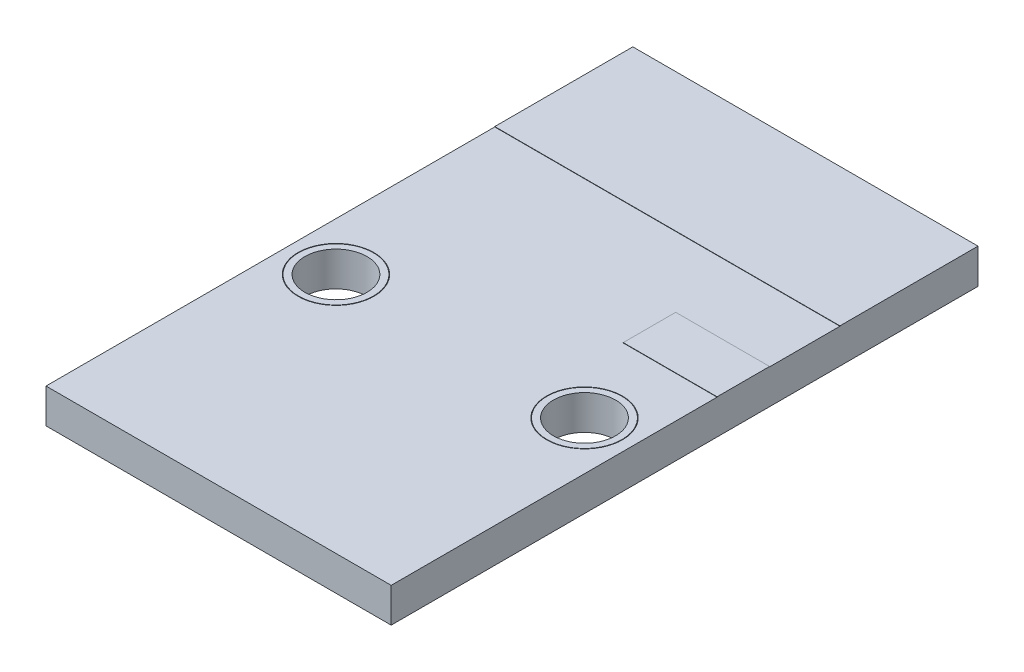
ISO-10303-21;
HEADER;
FILE_DESCRIPTION(('STEP AP214'),'2;1');
FILE_NAME('part.step','',(''),(''),'','','');
FILE_SCHEMA(('AUTOMOTIVE_DESIGN { 1 0 10303 214 1 1 1 1 }'));
ENDSEC;
DATA;
#1=APPLICATION_CONTEXT('core data for automotive mechanical design processes');
#2=APPLICATION_PROTOCOL_DEFINITION('international standard','automotive_design',2000,#1);
#3=PRODUCT_CONTEXT('',#1,'mechanical');
#4=PRODUCT('Part','Part','',(#3));
#5=PRODUCT_RELATED_PRODUCT_CATEGORY('part','',(#4));
#6=PRODUCT_DEFINITION_FORMATION('','',#4);
#7=PRODUCT_DEFINITION_CONTEXT('part definition',#1,'design');
#8=PRODUCT_DEFINITION('design','',#6,#7);
#9=PRODUCT_DEFINITION_SHAPE('','',#8);
#10=(LENGTH_UNIT() NAMED_UNIT(*) SI_UNIT(.MILLI.,.METRE.));
#11=(NAMED_UNIT(*) PLANE_ANGLE_UNIT() SI_UNIT($,.RADIAN.));
#12=(NAMED_UNIT(*) SI_UNIT($,.STERADIAN.) SOLID_ANGLE_UNIT());
#13=UNCERTAINTY_MEASURE_WITH_UNIT(LENGTH_MEASURE(1.E-05),#10,'distance_accuracy_value','');
#14=(GEOMETRIC_REPRESENTATION_CONTEXT(3) GLOBAL_UNCERTAINTY_ASSIGNED_CONTEXT((#13)) GLOBAL_UNIT_ASSIGNED_CONTEXT((#10,
#11,#12)) REPRESENTATION_CONTEXT('',''));
#15=CARTESIAN_POINT('',(0.,0.,0.));
#16=DIRECTION('',(0.,0.,1.));
#17=DIRECTION('',(1.,0.,0.));
#18=AXIS2_PLACEMENT_3D('',#15,#16,#17);
#19=CARTESIAN_POINT('',(1.4,0.,10.));
#20=DIRECTION('',(0.,1.,0.));
#21=DIRECTION('',(0.,0.,1.));
#22=AXIS2_PLACEMENT_3D('',#19,#20,#21);
#23=CYLINDRICAL_SURFACE('',#22,1.0854263270172);
#24=CARTESIAN_POINT('',(1.4,0.,10.));
#25=DIRECTION('',(0.,1.,0.));
#26=DIRECTION('',(0.,0.,1.));
#27=AXIS2_PLACEMENT_3D('',#24,#25,#26);
#28=CIRCLE('',#27,1.0854263270172);
#29=CARTESIAN_POINT('',(1.4,0.,11.0854263270172));
#30=VERTEX_POINT('',#29);
#31=EDGE_CURVE('E11',#30,#30,#28,.T.);
#32=ORIENTED_EDGE('',*,*,#31,.T.);
#33=EDGE_LOOP('',(#32));
#34=FACE_BOUND('',#33,.T.);
#35=CARTESIAN_POINT('',(1.4,1.,10.));
#36=DIRECTION('',(0.,1.,0.));
#37=DIRECTION('',(0.,0.,1.));
#38=AXIS2_PLACEMENT_3D('',#35,#36,#37);
#39=CIRCLE('',#38,1.0854263270172);
#40=CARTESIAN_POINT('',(1.4,1.,11.0854263270172));
#41=VERTEX_POINT('',#40);
#42=EDGE_CURVE('E48',#41,#41,#39,.T.);
#43=ORIENTED_EDGE('',*,*,#42,.F.);
#44=EDGE_LOOP('',(#43));
#45=FACE_BOUND('',#44,.T.);
#46=ADVANCED_FACE('F45',(#34,#45),#23,.T.);
#47=CARTESIAN_POINT('',(1.4,0.,10.));
#48=DIRECTION('',(0.,1.,0.));
#49=DIRECTION('',(0.,0.,1.));
#50=AXIS2_PLACEMENT_3D('',#47,#48,#49);
#51=PLANE('',#50);
#52=CARTESIAN_POINT('',(1.4,0.,10.));
#53=DIRECTION('',(0.,1.,0.));
#54=DIRECTION('',(0.,0.,1.));
#55=AXIS2_PLACEMENT_3D('',#52,#53,#54);
#56=CIRCLE('',#55,0.9);
#57=CARTESIAN_POINT('',(1.4,0.,10.9));
#58=VERTEX_POINT('',#57);
#59=EDGE_CURVE('E55',#58,#58,#56,.T.);
#60=ORIENTED_EDGE('',*,*,#59,.T.);
#61=EDGE_LOOP('',(#60));
#62=FACE_BOUND('',#61,.T.);
#63=ORIENTED_EDGE('',*,*,#31,.F.);
#64=EDGE_LOOP('',(#63));
#65=FACE_BOUND('',#64,.T.);
#66=ADVANCED_FACE('F63',(#62,#65),#51,.F.);
#67=CARTESIAN_POINT('',(1.4,1.,10.));
#68=DIRECTION('',(0.,1.,0.));
#69=DIRECTION('',(0.,0.,1.));
#70=AXIS2_PLACEMENT_3D('',#67,#68,#69);
#71=PLANE('',#70);
#72=CARTESIAN_POINT('',(1.4,1.,10.));
#73=DIRECTION('',(0.,1.,0.));
#74=DIRECTION('',(0.,0.,1.));
#75=AXIS2_PLACEMENT_3D('',#72,#73,#74);
#76=CIRCLE('',#75,0.9);
#77=CARTESIAN_POINT('',(1.4,1.,10.9));
#78=VERTEX_POINT('',#77);
#79=EDGE_CURVE('E57',#78,#78,#76,.T.);
#80=ORIENTED_EDGE('',*,*,#79,.F.);
#81=EDGE_LOOP('',(#80));
#82=FACE_BOUND('',#81,.T.);
#83=ORIENTED_EDGE('',*,*,#42,.T.);
#84=EDGE_LOOP('',(#83));
#85=FACE_BOUND('',#84,.T.);
#86=ADVANCED_FACE('F69',(#82,#85),#71,.T.);
#87=CARTESIAN_POINT('',(1.4,0.,10.));
#88=DIRECTION('',(0.,1.,0.));
#89=DIRECTION('',(0.,0.,1.));
#90=AXIS2_PLACEMENT_3D('',#87,#88,#89);
#91=CYLINDRICAL_SURFACE('',#90,0.9);
#92=ORIENTED_EDGE('',*,*,#59,.F.);
#93=EDGE_LOOP('',(#92));
#94=FACE_BOUND('',#93,.T.);
#95=ORIENTED_EDGE('',*,*,#79,.T.);
#96=EDGE_LOOP('',(#95));
#97=FACE_BOUND('',#96,.T.);
#98=ADVANCED_FACE('F66',(#94,#97),#91,.F.);
#99=CLOSED_SHELL('',(#46,#66,#86,#98));
#100=MANIFOLD_SOLID_BREP('B2',#99);
#101=CARTESIAN_POINT('',(8.6,0.,10.));
#102=DIRECTION('',(0.,1.,0.));
#103=DIRECTION('',(0.,0.,1.));
#104=AXIS2_PLACEMENT_3D('',#101,#102,#103);
#105=CYLINDRICAL_SURFACE('',#104,1.08573606300248);
#106=CARTESIAN_POINT('',(8.6,0.,10.));
#107=DIRECTION('',(0.,1.,0.));
#108=DIRECTION('',(0.,0.,1.));
#109=AXIS2_PLACEMENT_3D('',#106,#107,#108);
#110=CIRCLE('',#109,1.08573606300248);
#111=CARTESIAN_POINT('',(8.6,0.,11.0857360630025));
#112=VERTEX_POINT('',#111);
#113=EDGE_CURVE('E44',#112,#112,#110,.T.);
#114=ORIENTED_EDGE('',*,*,#113,.T.);
#115=EDGE_LOOP('',(#114));
#116=FACE_BOUND('',#115,.T.);
#117=CARTESIAN_POINT('',(8.6,1.,10.));
#118=DIRECTION('',(0.,1.,0.));
#119=DIRECTION('',(0.,0.,1.));
#120=AXIS2_PLACEMENT_3D('',#117,#118,#119);
#121=CIRCLE('',#120,1.08573606300248);
#122=CARTESIAN_POINT('',(8.6,1.,11.0857360630025));
#123=VERTEX_POINT('',#122);
#124=EDGE_CURVE('E118',#123,#123,#121,.T.);
#125=ORIENTED_EDGE('',*,*,#124,.F.);
#126=EDGE_LOOP('',(#125));
#127=FACE_BOUND('',#126,.T.);
#128=ADVANCED_FACE('F115',(#116,#127),#105,.T.);
#129=CARTESIAN_POINT('',(8.6,0.,10.));
#130=DIRECTION('',(0.,1.,0.));
#131=DIRECTION('',(0.,0.,1.));
#132=AXIS2_PLACEMENT_3D('',#129,#130,#131);
#133=PLANE('',#132);
#134=CARTESIAN_POINT('',(8.6,0.,10.));
#135=DIRECTION('',(0.,1.,0.));
#136=DIRECTION('',(0.,0.,1.));
#137=AXIS2_PLACEMENT_3D('',#134,#135,#136);
#138=CIRCLE('',#137,0.900000000000002);
#139=CARTESIAN_POINT('',(8.6,0.,10.9));
#140=VERTEX_POINT('',#139);
#141=EDGE_CURVE('E125',#140,#140,#138,.T.);
#142=ORIENTED_EDGE('',*,*,#141,.T.);
#143=EDGE_LOOP('',(#142));
#144=FACE_BOUND('',#143,.T.);
#145=ORIENTED_EDGE('',*,*,#113,.F.);
#146=EDGE_LOOP('',(#145));
#147=FACE_BOUND('',#146,.T.);
#148=ADVANCED_FACE('F133',(#144,#147),#133,.F.);
#149=CARTESIAN_POINT('',(8.6,1.,10.));
#150=DIRECTION('',(0.,1.,0.));
#151=DIRECTION('',(0.,0.,1.));
#152=AXIS2_PLACEMENT_3D('',#149,#150,#151);
#153=PLANE('',#152);
#154=CARTESIAN_POINT('',(8.6,1.,10.));
#155=DIRECTION('',(0.,1.,0.));
#156=DIRECTION('',(0.,0.,1.));
#157=AXIS2_PLACEMENT_3D('',#154,#155,#156);
#158=CIRCLE('',#157,0.900000000000002);
#159=CARTESIAN_POINT('',(8.6,1.,10.9));
#160=VERTEX_POINT('',#159);
#161=EDGE_CURVE('E127',#160,#160,#158,.T.);
#162=ORIENTED_EDGE('',*,*,#161,.F.);
#163=EDGE_LOOP('',(#162));
#164=FACE_BOUND('',#163,.T.);
#165=ORIENTED_EDGE('',*,*,#124,.T.);
#166=EDGE_LOOP('',(#165));
#167=FACE_BOUND('',#166,.T.);
#168=ADVANCED_FACE('F139',(#164,#167),#153,.T.);
#169=CARTESIAN_POINT('',(8.6,0.,10.));
#170=DIRECTION('',(0.,1.,0.));
#171=DIRECTION('',(0.,0.,1.));
#172=AXIS2_PLACEMENT_3D('',#169,#170,#171);
#173=CYLINDRICAL_SURFACE('',#172,0.900000000000002);
#174=ORIENTED_EDGE('',*,*,#141,.F.);
#175=EDGE_LOOP('',(#174));
#176=FACE_BOUND('',#175,.T.);
#177=ORIENTED_EDGE('',*,*,#161,.T.);
#178=EDGE_LOOP('',(#177));
#179=FACE_BOUND('',#178,.T.);
#180=ADVANCED_FACE('F136',(#176,#179),#173,.F.);
#181=CLOSED_SHELL('',(#128,#148,#168,#180));
#182=MANIFOLD_SOLID_BREP('B6',#181);
#183=CARTESIAN_POINT('',(0.,1.,0.));
#184=DIRECTION('',(0.,1.,0.));
#185=DIRECTION('',(0.,0.,1.));
#186=AXIS2_PLACEMENT_3D('',#183,#184,#185);
#187=PLANE('',#186);
#188=CARTESIAN_POINT('',(1.4,1.,10.));
#189=DIRECTION('',(0.,1.,0.));
#190=DIRECTION('',(0.,0.,1.));
#191=AXIS2_PLACEMENT_3D('',#188,#189,#190);
#192=CIRCLE('',#191,1.1);
#193=CARTESIAN_POINT('',(1.4,1.,11.1));
#194=VERTEX_POINT('',#193);
#195=EDGE_CURVE('E303',#194,#194,#192,.T.);
#196=ORIENTED_EDGE('',*,*,#195,.F.);
#197=EDGE_LOOP('',(#196));
#198=FACE_BOUND('',#197,.T.);
#199=CARTESIAN_POINT('',(8.6,1.,10.));
#200=DIRECTION('',(0.,1.,0.));
#201=DIRECTION('',(0.,0.,1.));
#202=AXIS2_PLACEMENT_3D('',#199,#200,#201);
#203=CIRCLE('',#202,1.1);
#204=CARTESIAN_POINT('',(8.6,1.,11.1));
#205=VERTEX_POINT('',#204);
#206=EDGE_CURVE('E298',#205,#205,#203,.T.);
#207=ORIENTED_EDGE('',*,*,#206,.F.);
#208=EDGE_LOOP('',(#207));
#209=FACE_BOUND('',#208,.T.);
#210=DIRECTION('',(0.,0.,1.));
#211=VECTOR('',#210,1.);
#212=CARTESIAN_POINT('',(7.28121156624932,1.,6.03870807749108));
#213=LINE('',#212,#211);
#214=CARTESIAN_POINT('',(7.28121156624932,1.,6.03870807749108));
#215=VERTEX_POINT('',#214);
#216=CARTESIAN_POINT('',(7.28121156624932,1.,7.55868921206423));
#217=VERTEX_POINT('',#216);
#218=EDGE_CURVE('E388',#215,#217,#213,.T.);
#219=ORIENTED_EDGE('',*,*,#218,.F.);
#220=DIRECTION('',(-1.,0.,0.));
#221=VECTOR('',#220,1.);
#222=CARTESIAN_POINT('',(10.,1.,6.03870807749108));
#223=LINE('',#222,#221);
#224=CARTESIAN_POINT('',(10.,1.,6.03870807749108));
#225=VERTEX_POINT('',#224);
#226=EDGE_CURVE('E390',#225,#215,#223,.T.);
#227=ORIENTED_EDGE('',*,*,#226,.F.);
#228=DIRECTION('',(0.,0.,-1.));
#229=VECTOR('',#228,1.);
#230=CARTESIAN_POINT('',(10.,1.,0.));
#231=LINE('',#230,#229);
#232=CARTESIAN_POINT('',(10.,1.,4.));
#233=VERTEX_POINT('',#232);
#234=EDGE_CURVE('E277',#225,#233,#231,.T.);
#235=ORIENTED_EDGE('',*,*,#234,.T.);
#236=DIRECTION('',(1.,0.,0.));
#237=VECTOR('',#236,1.);
#238=CARTESIAN_POINT('',(10.,1.,4.));
#239=LINE('',#238,#237);
#240=CARTESIAN_POINT('',(0.,1.,4.));
#241=VERTEX_POINT('',#240);
#242=EDGE_CURVE('E199',#241,#233,#239,.T.);
#243=ORIENTED_EDGE('',*,*,#242,.F.);
#244=DIRECTION('',(0.,0.,1.));
#245=VECTOR('',#244,1.);
#246=CARTESIAN_POINT('',(0.,1.,0.));
#247=LINE('',#246,#245);
#248=CARTESIAN_POINT('',(0.,1.,17.));
#249=VERTEX_POINT('',#248);
#250=EDGE_CURVE('E311',#241,#249,#247,.T.);
#251=ORIENTED_EDGE('',*,*,#250,.T.);
#252=DIRECTION('',(1.,0.,0.));
#253=VECTOR('',#252,1.);
#254=CARTESIAN_POINT('',(0.,1.,17.));
#255=LINE('',#254,#253);
#256=CARTESIAN_POINT('',(10.,1.,17.));
#257=VERTEX_POINT('',#256);
#258=EDGE_CURVE('E313',#249,#257,#255,.T.);
#259=ORIENTED_EDGE('',*,*,#258,.T.);
#260=CARTESIAN_POINT('',(10.,1.,7.55868921206423));
#261=VERTEX_POINT('',#260);
#262=EDGE_CURVE('E316',#257,#261,#231,.T.);
#263=ORIENTED_EDGE('',*,*,#262,.T.);
#264=DIRECTION('',(1.,0.,0.));
#265=VECTOR('',#264,1.);
#266=CARTESIAN_POINT('',(10.,1.,7.55868921206423));
#267=LINE('',#266,#265);
#268=EDGE_CURVE('E272',#217,#261,#267,.T.);
#269=ORIENTED_EDGE('',*,*,#268,.F.);
#270=EDGE_LOOP('',(#219,#227,#235,#243,#251,#259,#263,#269));
#271=FACE_BOUND('',#270,.T.);
#272=ADVANCED_FACE('F176',(#198,#209,#271),#187,.T.);
#273=CARTESIAN_POINT('',(0.,1.,0.));
#274=DIRECTION('',(1.,0.,0.));
#275=DIRECTION('',(0.,0.,-1.));
#276=AXIS2_PLACEMENT_3D('',#273,#274,#275);
#277=PLANE('',#276);
#278=DIRECTION('',(0.,0.,1.));
#279=VECTOR('',#278,1.);
#280=CARTESIAN_POINT('',(0.,0.,0.));
#281=LINE('',#280,#279);
#282=CARTESIAN_POINT('',(0.,0.,0.));
#283=VERTEX_POINT('',#282);
#284=CARTESIAN_POINT('',(0.,0.,17.));
#285=VERTEX_POINT('',#284);
#286=EDGE_CURVE('E302',#283,#285,#281,.T.);
#287=ORIENTED_EDGE('',*,*,#286,.T.);
#288=DIRECTION('',(0.,-1.,0.));
#289=VECTOR('',#288,1.);
#290=CARTESIAN_POINT('',(0.,1.,17.));
#291=LINE('',#290,#289);
#292=EDGE_CURVE('E113',#249,#285,#291,.T.);
#293=ORIENTED_EDGE('',*,*,#292,.F.);
#294=ORIENTED_EDGE('',*,*,#250,.F.);
#295=DIRECTION('',(0.,-1.,0.));
#296=VECTOR('',#295,1.);
#297=CARTESIAN_POINT('',(0.,1.01,4.));
#298=LINE('',#297,#296);
#299=CARTESIAN_POINT('',(0.,1.01,4.));
#300=VERTEX_POINT('',#299);
#301=EDGE_CURVE('E295',#300,#241,#298,.T.);
#302=ORIENTED_EDGE('',*,*,#301,.F.);
#303=DIRECTION('',(0.,0.,1.));
#304=VECTOR('',#303,1.);
#305=CARTESIAN_POINT('',(0.,1.01,0.));
#306=LINE('',#305,#304);
#307=CARTESIAN_POINT('',(0.,1.01,0.));
#308=VERTEX_POINT('',#307);
#309=EDGE_CURVE('E289',#308,#300,#306,.T.);
#310=ORIENTED_EDGE('',*,*,#309,.F.);
#311=DIRECTION('',(0.,-1.,0.));
#312=VECTOR('',#311,1.);
#313=CARTESIAN_POINT('',(0.,1.,0.));
#314=LINE('',#313,#312);
#315=EDGE_CURVE('E319',#308,#283,#314,.T.);
#316=ORIENTED_EDGE('',*,*,#315,.T.);
#317=EDGE_LOOP('',(#287,#293,#294,#302,#310,#316));
#318=FACE_BOUND('',#317,.T.);
#319=ADVANCED_FACE('F178',(#318),#277,.F.);
#320=CARTESIAN_POINT('',(0.,1.,17.));
#321=DIRECTION('',(0.,0.,-1.));
#322=DIRECTION('',(-1.,0.,0.));
#323=AXIS2_PLACEMENT_3D('',#320,#321,#322);
#324=PLANE('',#323);
#325=DIRECTION('',(1.,0.,0.));
#326=VECTOR('',#325,1.);
#327=CARTESIAN_POINT('',(0.,0.,17.));
#328=LINE('',#327,#326);
#329=CARTESIAN_POINT('',(10.,0.,17.));
#330=VERTEX_POINT('',#329);
#331=EDGE_CURVE('E322',#285,#330,#328,.T.);
#332=ORIENTED_EDGE('',*,*,#331,.T.);
#333=DIRECTION('',(0.,-1.,0.));
#334=VECTOR('',#333,1.);
#335=CARTESIAN_POINT('',(10.,1.,17.));
#336=LINE('',#335,#334);
#337=EDGE_CURVE('E184',#257,#330,#336,.T.);
#338=ORIENTED_EDGE('',*,*,#337,.F.);
#339=ORIENTED_EDGE('',*,*,#258,.F.);
#340=ORIENTED_EDGE('',*,*,#292,.T.);
#341=EDGE_LOOP('',(#332,#338,#339,#340));
#342=FACE_BOUND('',#341,.T.);
#343=ADVANCED_FACE('F372',(#342),#324,.F.);
#344=CARTESIAN_POINT('',(10.,1.,0.));
#345=DIRECTION('',(-1.,0.,0.));
#346=DIRECTION('',(0.,0.,1.));
#347=AXIS2_PLACEMENT_3D('',#344,#345,#346);
#348=PLANE('',#347);
#349=DIRECTION('',(0.,0.,-1.));
#350=VECTOR('',#349,1.);
#351=CARTESIAN_POINT('',(10.,0.,0.));
#352=LINE('',#351,#350);
#353=CARTESIAN_POINT('',(10.,0.,0.));
#354=VERTEX_POINT('',#353);
#355=EDGE_CURVE('E324',#330,#354,#352,.T.);
#356=ORIENTED_EDGE('',*,*,#355,.T.);
#357=DIRECTION('',(0.,-1.,0.));
#358=VECTOR('',#357,1.);
#359=CARTESIAN_POINT('',(10.,1.,0.));
#360=LINE('',#359,#358);
#361=CARTESIAN_POINT('',(10.,1.01,0.));
#362=VERTEX_POINT('',#361);
#363=EDGE_CURVE('E329',#362,#354,#360,.T.);
#364=ORIENTED_EDGE('',*,*,#363,.F.);
#365=DIRECTION('',(0.,0.,-1.));
#366=VECTOR('',#365,1.);
#367=CARTESIAN_POINT('',(10.,1.01,0.));
#368=LINE('',#367,#366);
#369=CARTESIAN_POINT('',(10.,1.01,4.));
#370=VERTEX_POINT('',#369);
#371=EDGE_CURVE('E279',#370,#362,#368,.T.);
#372=ORIENTED_EDGE('',*,*,#371,.F.);
#373=DIRECTION('',(0.,-1.,0.));
#374=VECTOR('',#373,1.);
#375=CARTESIAN_POINT('',(10.,1.01,4.));
#376=LINE('',#375,#374);
#377=EDGE_CURVE('E292',#370,#233,#376,.T.);
#378=ORIENTED_EDGE('',*,*,#377,.T.);
#379=ORIENTED_EDGE('',*,*,#234,.F.);
#380=DIRECTION('',(0.,-1.,0.));
#381=VECTOR('',#380,1.);
#382=CARTESIAN_POINT('',(10.,1.01,6.03870807749108));
#383=LINE('',#382,#381);
#384=CARTESIAN_POINT('',(10.,1.01,6.03870807749108));
#385=VERTEX_POINT('',#384);
#386=EDGE_CURVE('E257',#385,#225,#383,.T.);
#387=ORIENTED_EDGE('',*,*,#386,.F.);
#388=DIRECTION('',(0.,0.,-1.));
#389=VECTOR('',#388,1.);
#390=CARTESIAN_POINT('',(10.,1.01,6.03870807749108));
#391=LINE('',#390,#389);
#392=CARTESIAN_POINT('',(10.,1.01,7.55868921206423));
#393=VERTEX_POINT('',#392);
#394=EDGE_CURVE('E264',#393,#385,#391,.T.);
#395=ORIENTED_EDGE('',*,*,#394,.F.);
#396=DIRECTION('',(0.,-1.,0.));
#397=VECTOR('',#396,1.);
#398=CARTESIAN_POINT('',(10.,1.01,7.55868921206423));
#399=LINE('',#398,#397);
#400=EDGE_CURVE('E394',#393,#261,#399,.T.);
#401=ORIENTED_EDGE('',*,*,#400,.T.);
#402=ORIENTED_EDGE('',*,*,#262,.F.);
#403=ORIENTED_EDGE('',*,*,#337,.T.);
#404=EDGE_LOOP('',(#356,#364,#372,#378,#379,#387,#395,#401,#402,#403));
#405=FACE_BOUND('',#404,.T.);
#406=ADVANCED_FACE('F275',(#405),#348,.F.);
#407=CARTESIAN_POINT('',(0.,1.,0.));
#408=DIRECTION('',(0.,0.,1.));
#409=DIRECTION('',(1.,0.,0.));
#410=AXIS2_PLACEMENT_3D('',#407,#408,#409);
#411=PLANE('',#410);
#412=DIRECTION('',(-1.,0.,0.));
#413=VECTOR('',#412,1.);
#414=CARTESIAN_POINT('',(0.,0.,0.));
#415=LINE('',#414,#413);
#416=EDGE_CURVE('E314',#354,#283,#415,.T.);
#417=ORIENTED_EDGE('',*,*,#416,.T.);
#418=ORIENTED_EDGE('',*,*,#315,.F.);
#419=DIRECTION('',(-1.,0.,0.));
#420=VECTOR('',#419,1.);
#421=CARTESIAN_POINT('',(10.,1.01,0.));
#422=LINE('',#421,#420);
#423=EDGE_CURVE('E286',#362,#308,#422,.T.);
#424=ORIENTED_EDGE('',*,*,#423,.F.);
#425=ORIENTED_EDGE('',*,*,#363,.T.);
#426=EDGE_LOOP('',(#417,#418,#424,#425));
#427=FACE_BOUND('',#426,.T.);
#428=ADVANCED_FACE('F342',(#427),#411,.F.);
#429=CARTESIAN_POINT('',(0.,0.,0.));
#430=DIRECTION('',(0.,1.,0.));
#431=DIRECTION('',(0.,0.,1.));
#432=AXIS2_PLACEMENT_3D('',#429,#430,#431);
#433=PLANE('',#432);
#434=CARTESIAN_POINT('',(1.4,0.,10.));
#435=DIRECTION('',(0.,1.,0.));
#436=DIRECTION('',(0.,0.,1.));
#437=AXIS2_PLACEMENT_3D('',#434,#435,#436);
#438=CIRCLE('',#437,1.1);
#439=CARTESIAN_POINT('',(1.4,0.,11.1));
#440=VERTEX_POINT('',#439);
#441=EDGE_CURVE('E299',#440,#440,#438,.T.);
#442=ORIENTED_EDGE('',*,*,#441,.T.);
#443=EDGE_LOOP('',(#442));
#444=FACE_BOUND('',#443,.T.);
#445=CARTESIAN_POINT('',(8.6,0.,10.));
#446=DIRECTION('',(0.,1.,0.));
#447=DIRECTION('',(0.,0.,1.));
#448=AXIS2_PLACEMENT_3D('',#445,#446,#447);
#449=CIRCLE('',#448,1.1);
#450=CARTESIAN_POINT('',(8.6,0.,11.1));
#451=VERTEX_POINT('',#450);
#452=EDGE_CURVE('E306',#451,#451,#449,.T.);
#453=ORIENTED_EDGE('',*,*,#452,.T.);
#454=EDGE_LOOP('',(#453));
#455=FACE_BOUND('',#454,.T.);
#456=ORIENTED_EDGE('',*,*,#286,.F.);
#457=ORIENTED_EDGE('',*,*,#416,.F.);
#458=ORIENTED_EDGE('',*,*,#355,.F.);
#459=ORIENTED_EDGE('',*,*,#331,.F.);
#460=EDGE_LOOP('',(#456,#457,#458,#459));
#461=FACE_BOUND('',#460,.T.);
#462=ADVANCED_FACE('F340',(#444,#455,#461),#433,.F.);
#463=CARTESIAN_POINT('',(8.6,0.,10.));
#464=DIRECTION('',(0.,1.,0.));
#465=DIRECTION('',(0.,0.,1.));
#466=AXIS2_PLACEMENT_3D('',#463,#464,#465);
#467=CYLINDRICAL_SURFACE('',#466,1.1);
#468=ORIENTED_EDGE('',*,*,#452,.F.);
#469=EDGE_LOOP('',(#468));
#470=FACE_BOUND('',#469,.T.);
#471=ORIENTED_EDGE('',*,*,#206,.T.);
#472=EDGE_LOOP('',(#471));
#473=FACE_BOUND('',#472,.T.);
#474=ADVANCED_FACE('F363',(#470,#473),#467,.F.);
#475=CARTESIAN_POINT('',(1.4,0.,10.));
#476=DIRECTION('',(0.,1.,0.));
#477=DIRECTION('',(0.,0.,1.));
#478=AXIS2_PLACEMENT_3D('',#475,#476,#477);
#479=CYLINDRICAL_SURFACE('',#478,1.1);
#480=ORIENTED_EDGE('',*,*,#441,.F.);
#481=EDGE_LOOP('',(#480));
#482=FACE_BOUND('',#481,.T.);
#483=ORIENTED_EDGE('',*,*,#195,.T.);
#484=EDGE_LOOP('',(#483));
#485=FACE_BOUND('',#484,.T.);
#486=ADVANCED_FACE('F356',(#482,#485),#479,.F.);
#487=CARTESIAN_POINT('',(10.,1.01,4.));
#488=DIRECTION('',(0.,0.,-1.));
#489=DIRECTION('',(-1.,0.,0.));
#490=AXIS2_PLACEMENT_3D('',#487,#488,#489);
#491=PLANE('',#490);
#492=ORIENTED_EDGE('',*,*,#242,.T.);
#493=ORIENTED_EDGE('',*,*,#377,.F.);
#494=DIRECTION('',(1.,0.,0.));
#495=VECTOR('',#494,1.);
#496=CARTESIAN_POINT('',(10.,1.01,4.));
#497=LINE('',#496,#495);
#498=EDGE_CURVE('E291',#300,#370,#497,.T.);
#499=ORIENTED_EDGE('',*,*,#498,.F.);
#500=ORIENTED_EDGE('',*,*,#301,.T.);
#501=EDGE_LOOP('',(#492,#493,#499,#500));
#502=FACE_BOUND('',#501,.T.);
#503=ADVANCED_FACE('F354',(#502),#491,.F.);
#504=CARTESIAN_POINT('',(0.,1.01,0.));
#505=DIRECTION('',(0.,-1.,0.));
#506=DIRECTION('',(0.,0.,-1.));
#507=AXIS2_PLACEMENT_3D('',#504,#505,#506);
#508=PLANE('',#507);
#509=ORIENTED_EDGE('',*,*,#371,.T.);
#510=ORIENTED_EDGE('',*,*,#423,.T.);
#511=ORIENTED_EDGE('',*,*,#309,.T.);
#512=ORIENTED_EDGE('',*,*,#498,.T.);
#513=EDGE_LOOP('',(#509,#510,#511,#512));
#514=FACE_BOUND('',#513,.T.);
#515=ADVANCED_FACE('F350',(#514),#508,.F.);
#516=CARTESIAN_POINT('',(10.,1.01,6.03870807749108));
#517=DIRECTION('',(0.,0.,1.));
#518=DIRECTION('',(1.,0.,0.));
#519=AXIS2_PLACEMENT_3D('',#516,#517,#518);
#520=PLANE('',#519);
#521=ORIENTED_EDGE('',*,*,#226,.T.);
#522=DIRECTION('',(0.,-1.,0.));
#523=VECTOR('',#522,1.);
#524=CARTESIAN_POINT('',(7.28121156624932,1.01,6.03870807749108));
#525=LINE('',#524,#523);
#526=CARTESIAN_POINT('',(7.28121156624932,1.01,6.03870807749108));
#527=VERTEX_POINT('',#526);
#528=EDGE_CURVE('E260',#527,#215,#525,.T.);
#529=ORIENTED_EDGE('',*,*,#528,.F.);
#530=DIRECTION('',(-1.,0.,0.));
#531=VECTOR('',#530,1.);
#532=CARTESIAN_POINT('',(10.,1.01,6.03870807749108));
#533=LINE('',#532,#531);
#534=EDGE_CURVE('E253',#385,#527,#533,.T.);
#535=ORIENTED_EDGE('',*,*,#534,.F.);
#536=ORIENTED_EDGE('',*,*,#386,.T.);
#537=EDGE_LOOP('',(#521,#529,#535,#536));
#538=FACE_BOUND('',#537,.T.);
#539=ADVANCED_FACE('F255',(#538),#520,.F.);
#540=CARTESIAN_POINT('',(7.28121156624932,1.01,6.03870807749108));
#541=DIRECTION('',(1.,0.,0.));
#542=DIRECTION('',(0.,0.,-1.));
#543=AXIS2_PLACEMENT_3D('',#540,#541,#542);
#544=PLANE('',#543);
#545=ORIENTED_EDGE('',*,*,#218,.T.);
#546=DIRECTION('',(0.,-1.,0.));
#547=VECTOR('',#546,1.);
#548=CARTESIAN_POINT('',(7.28121156624932,1.01,7.55868921206423));
#549=LINE('',#548,#547);
#550=CARTESIAN_POINT('',(7.28121156624932,1.01,7.55868921206423));
#551=VERTEX_POINT('',#550);
#552=EDGE_CURVE('E191',#551,#217,#549,.T.);
#553=ORIENTED_EDGE('',*,*,#552,.F.);
#554=DIRECTION('',(0.,0.,1.));
#555=VECTOR('',#554,1.);
#556=CARTESIAN_POINT('',(7.28121156624932,1.01,6.03870807749108));
#557=LINE('',#556,#555);
#558=EDGE_CURVE('E263',#527,#551,#557,.T.);
#559=ORIENTED_EDGE('',*,*,#558,.F.);
#560=ORIENTED_EDGE('',*,*,#528,.T.);
#561=EDGE_LOOP('',(#545,#553,#559,#560));
#562=FACE_BOUND('',#561,.T.);
#563=ADVANCED_FACE('F398',(#562),#544,.F.);
#564=CARTESIAN_POINT('',(10.,1.01,7.55868921206423));
#565=DIRECTION('',(0.,0.,-1.));
#566=DIRECTION('',(-1.,0.,0.));
#567=AXIS2_PLACEMENT_3D('',#564,#565,#566);
#568=PLANE('',#567);
#569=ORIENTED_EDGE('',*,*,#268,.T.);
#570=ORIENTED_EDGE('',*,*,#400,.F.);
#571=DIRECTION('',(1.,0.,0.));
#572=VECTOR('',#571,1.);
#573=CARTESIAN_POINT('',(10.,1.01,7.55868921206423));
#574=LINE('',#573,#572);
#575=EDGE_CURVE('E268',#551,#393,#574,.T.);
#576=ORIENTED_EDGE('',*,*,#575,.F.);
#577=ORIENTED_EDGE('',*,*,#552,.T.);
#578=EDGE_LOOP('',(#569,#570,#576,#577));
#579=FACE_BOUND('',#578,.T.);
#580=ADVANCED_FACE('F399',(#579),#568,.F.);
#581=CARTESIAN_POINT('',(0.,1.01,0.));
#582=DIRECTION('',(0.,-1.,0.));
#583=DIRECTION('',(0.,0.,-1.));
#584=AXIS2_PLACEMENT_3D('',#581,#582,#583);
#585=PLANE('',#584);
#586=ORIENTED_EDGE('',*,*,#394,.T.);
#587=ORIENTED_EDGE('',*,*,#534,.T.);
#588=ORIENTED_EDGE('',*,*,#558,.T.);
#589=ORIENTED_EDGE('',*,*,#575,.T.);
#590=EDGE_LOOP('',(#586,#587,#588,#589));
#591=FACE_BOUND('',#590,.T.);
#592=ADVANCED_FACE('F267',(#591),#585,.F.);
#593=CLOSED_SHELL('',(#272,#319,#343,#406,#428,#462,#474,#486,#503,#515,#539,#563,#580,#592));
#594=MANIFOLD_SOLID_BREP('B39',#593);
#595=ADVANCED_BREP_SHAPE_REPRESENTATION('',(#18,#100,#182,#594),#14);
#596=SHAPE_DEFINITION_REPRESENTATION(#9,#595);
ENDSEC;
END-ISO-10303-21;
